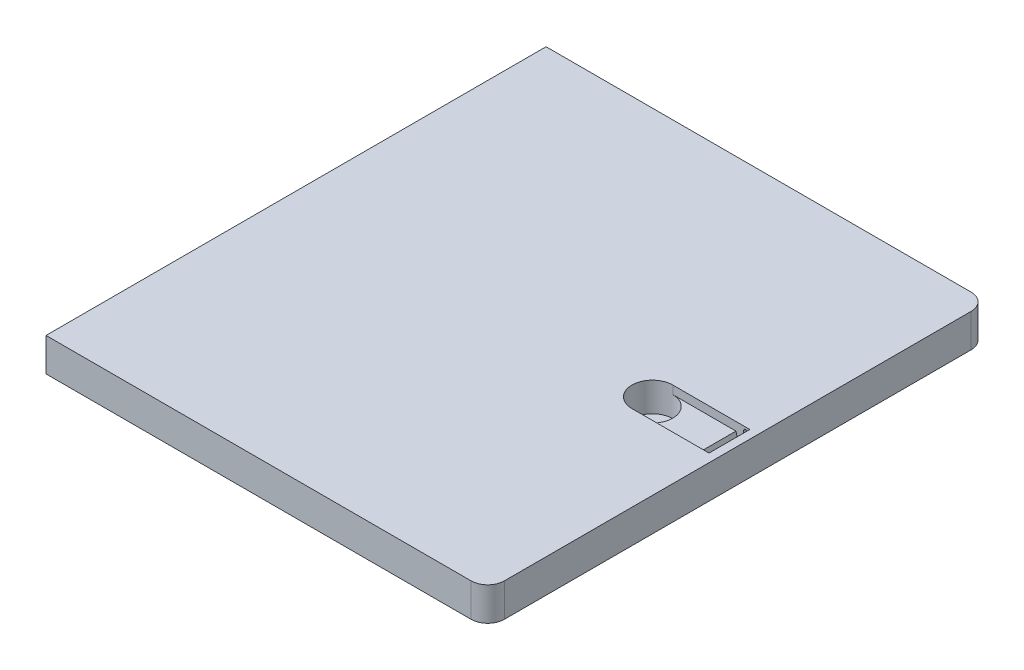
ISO-10303-21;
HEADER;
FILE_DESCRIPTION(('STEP AP214'),'2;1');
FILE_NAME('part.step','',(''),(''),'','','');
FILE_SCHEMA(('AUTOMOTIVE_DESIGN { 1 0 10303 214 1 1 1 1 }'));
ENDSEC;
DATA;
#1=APPLICATION_CONTEXT('core data for automotive mechanical design processes');
#2=APPLICATION_PROTOCOL_DEFINITION('international standard','automotive_design',2000,#1);
#3=PRODUCT_CONTEXT('',#1,'mechanical');
#4=PRODUCT('Part','Part','',(#3));
#5=PRODUCT_RELATED_PRODUCT_CATEGORY('part','',(#4));
#6=PRODUCT_DEFINITION_FORMATION('','',#4);
#7=PRODUCT_DEFINITION_CONTEXT('part definition',#1,'design');
#8=PRODUCT_DEFINITION('design','',#6,#7);
#9=PRODUCT_DEFINITION_SHAPE('','',#8);
#10=(LENGTH_UNIT() NAMED_UNIT(*) SI_UNIT(.MILLI.,.METRE.));
#11=(NAMED_UNIT(*) PLANE_ANGLE_UNIT() SI_UNIT($,.RADIAN.));
#12=(NAMED_UNIT(*) SI_UNIT($,.STERADIAN.) SOLID_ANGLE_UNIT());
#13=UNCERTAINTY_MEASURE_WITH_UNIT(LENGTH_MEASURE(1.E-05),#10,'distance_accuracy_value','');
#14=(GEOMETRIC_REPRESENTATION_CONTEXT(3) GLOBAL_UNCERTAINTY_ASSIGNED_CONTEXT((#13)) GLOBAL_UNIT_ASSIGNED_CONTEXT((#10,
#11,#12)) REPRESENTATION_CONTEXT('',''));
#15=CARTESIAN_POINT('',(0.,0.,0.));
#16=DIRECTION('',(0.,0.,1.));
#17=DIRECTION('',(1.,0.,0.));
#18=AXIS2_PLACEMENT_3D('',#15,#16,#17);
#19=CARTESIAN_POINT('',(0.,-8.,60.));
#20=DIRECTION('',(0.,0.,1.));
#21=DIRECTION('',(1.,0.,0.));
#22=AXIS2_PLACEMENT_3D('',#19,#20,#21);
#23=PLANE('',#22);
#24=DIRECTION('',(1.,0.,0.));
#25=VECTOR('',#24,1.);
#26=CARTESIAN_POINT('',(0.,-8.,60.));
#27=LINE('',#26,#25);
#28=CARTESIAN_POINT('',(-106.,-8.,60.));
#29=VERTEX_POINT('',#28);
#30=CARTESIAN_POINT('',(-4.,-8.,60.));
#31=VERTEX_POINT('',#30);
#32=EDGE_CURVE('E293',#29,#31,#27,.T.);
#33=ORIENTED_EDGE('',*,*,#32,.T.);
#34=DIRECTION('',(0.,1.,0.));
#35=VECTOR('',#34,1.);
#36=CARTESIAN_POINT('',(-4.,-8.,60.));
#37=LINE('',#36,#35);
#38=CARTESIAN_POINT('',(-4.,0.,60.));
#39=VERTEX_POINT('',#38);
#40=EDGE_CURVE('E308',#31,#39,#37,.T.);
#41=ORIENTED_EDGE('',*,*,#40,.T.);
#42=DIRECTION('',(1.,0.,0.));
#43=VECTOR('',#42,1.);
#44=CARTESIAN_POINT('',(0.,0.,60.));
#45=LINE('',#44,#43);
#46=CARTESIAN_POINT('',(-106.,0.,60.));
#47=VERTEX_POINT('',#46);
#48=EDGE_CURVE('E289',#47,#39,#45,.T.);
#49=ORIENTED_EDGE('',*,*,#48,.F.);
#50=DIRECTION('',(0.,1.,0.));
#51=VECTOR('',#50,1.);
#52=CARTESIAN_POINT('',(-106.,-8.,60.));
#53=LINE('',#52,#51);
#54=EDGE_CURVE('E306',#29,#47,#53,.T.);
#55=ORIENTED_EDGE('',*,*,#54,.F.);
#56=EDGE_LOOP('',(#33,#41,#49,#55));
#57=FACE_BOUND('',#56,.T.);
#58=ADVANCED_FACE('F32',(#57),#23,.T.);
#59=CARTESIAN_POINT('',(-106.,-8.,0.));
#60=DIRECTION('',(-1.,0.,0.));
#61=DIRECTION('',(0.,0.,1.));
#62=AXIS2_PLACEMENT_3D('',#59,#60,#61);
#63=PLANE('',#62);
#64=DIRECTION('',(0.,0.,1.));
#65=VECTOR('',#64,1.);
#66=CARTESIAN_POINT('',(-106.,0.,0.));
#67=LINE('',#66,#65);
#68=CARTESIAN_POINT('',(-106.,0.,-60.));
#69=VERTEX_POINT('',#68);
#70=EDGE_CURVE('E301',#69,#47,#67,.T.);
#71=ORIENTED_EDGE('',*,*,#70,.F.);
#72=DIRECTION('',(0.,1.,0.));
#73=VECTOR('',#72,1.);
#74=CARTESIAN_POINT('',(-106.,-8.,-60.));
#75=LINE('',#74,#73);
#76=CARTESIAN_POINT('',(-106.,-8.,-60.));
#77=VERTEX_POINT('',#76);
#78=EDGE_CURVE('E296',#77,#69,#75,.T.);
#79=ORIENTED_EDGE('',*,*,#78,.F.);
#80=DIRECTION('',(0.,0.,1.));
#81=VECTOR('',#80,1.);
#82=CARTESIAN_POINT('',(-106.,-8.,0.));
#83=LINE('',#82,#81);
#84=EDGE_CURVE('E291',#77,#29,#83,.T.);
#85=ORIENTED_EDGE('',*,*,#84,.T.);
#86=ORIENTED_EDGE('',*,*,#54,.T.);
#87=EDGE_LOOP('',(#71,#79,#85,#86));
#88=FACE_BOUND('',#87,.T.);
#89=ADVANCED_FACE('F358',(#88),#63,.T.);
#90=CARTESIAN_POINT('',(0.,-8.,-60.));
#91=DIRECTION('',(0.,0.,-1.));
#92=DIRECTION('',(-1.,0.,0.));
#93=AXIS2_PLACEMENT_3D('',#90,#91,#92);
#94=PLANE('',#93);
#95=DIRECTION('',(-1.,0.,0.));
#96=VECTOR('',#95,1.);
#97=CARTESIAN_POINT('',(0.,0.,-60.));
#98=LINE('',#97,#96);
#99=CARTESIAN_POINT('',(-4.,0.,-60.));
#100=VERTEX_POINT('',#99);
#101=EDGE_CURVE('E299',#100,#69,#98,.T.);
#102=ORIENTED_EDGE('',*,*,#101,.F.);
#103=DIRECTION('',(0.,1.,0.));
#104=VECTOR('',#103,1.);
#105=CARTESIAN_POINT('',(-4.,-8.,-60.));
#106=LINE('',#105,#104);
#107=CARTESIAN_POINT('',(-4.,-8.,-60.));
#108=VERTEX_POINT('',#107);
#109=EDGE_CURVE('E326',#100,#108,#106,.F.);
#110=ORIENTED_EDGE('',*,*,#109,.T.);
#111=DIRECTION('',(-1.,0.,0.));
#112=VECTOR('',#111,1.);
#113=CARTESIAN_POINT('',(0.,-8.,-60.));
#114=LINE('',#113,#112);
#115=EDGE_CURVE('E288',#108,#77,#114,.T.);
#116=ORIENTED_EDGE('',*,*,#115,.T.);
#117=ORIENTED_EDGE('',*,*,#78,.T.);
#118=EDGE_LOOP('',(#102,#110,#116,#117));
#119=FACE_BOUND('',#118,.T.);
#120=ADVANCED_FACE('F332',(#119),#94,.T.);
#121=CARTESIAN_POINT('',(0.,-8.,0.));
#122=DIRECTION('',(1.,0.,0.));
#123=DIRECTION('',(0.,0.,-1.));
#124=AXIS2_PLACEMENT_3D('',#121,#122,#123);
#125=PLANE('',#124);
#126=DIRECTION('',(0.,0.,-1.));
#127=VECTOR('',#126,1.);
#128=CARTESIAN_POINT('',(0.,0.,0.));
#129=LINE('',#128,#127);
#130=CARTESIAN_POINT('',(0.,0.,56.));
#131=VERTEX_POINT('',#130);
#132=CARTESIAN_POINT('',(0.,0.,-56.));
#133=VERTEX_POINT('',#132);
#134=EDGE_CURVE('E279',#131,#133,#129,.T.);
#135=ORIENTED_EDGE('',*,*,#134,.F.);
#136=DIRECTION('',(0.,1.,0.));
#137=VECTOR('',#136,1.);
#138=CARTESIAN_POINT('',(0.,-8.,56.));
#139=LINE('',#138,#137);
#140=CARTESIAN_POINT('',(0.,-8.,56.));
#141=VERTEX_POINT('',#140);
#142=EDGE_CURVE('E320',#131,#141,#139,.F.);
#143=ORIENTED_EDGE('',*,*,#142,.T.);
#144=DIRECTION('',(0.,0.,-1.));
#145=VECTOR('',#144,1.);
#146=CARTESIAN_POINT('',(0.,-8.,0.));
#147=LINE('',#146,#145);
#148=CARTESIAN_POINT('',(0.,-8.,-56.));
#149=VERTEX_POINT('',#148);
#150=EDGE_CURVE('E285',#141,#149,#147,.T.);
#151=ORIENTED_EDGE('',*,*,#150,.T.);
#152=DIRECTION('',(0.,1.,0.));
#153=VECTOR('',#152,1.);
#154=CARTESIAN_POINT('',(0.,-8.,-56.));
#155=LINE('',#154,#153);
#156=EDGE_CURVE('E317',#149,#133,#155,.T.);
#157=ORIENTED_EDGE('',*,*,#156,.T.);
#158=EDGE_LOOP('',(#135,#143,#151,#157));
#159=FACE_BOUND('',#158,.T.);
#160=ADVANCED_FACE('F345',(#159),#125,.T.);
#161=CARTESIAN_POINT('',(0.,-8.,0.));
#162=DIRECTION('',(0.,-1.,0.));
#163=DIRECTION('',(0.,0.,-1.));
#164=AXIS2_PLACEMENT_3D('',#161,#162,#163);
#165=PLANE('',#164);
#166=ORIENTED_EDGE('',*,*,#150,.F.);
#167=CARTESIAN_POINT('',(-4.,-8.,56.));
#168=DIRECTION('',(0.,-1.,0.));
#169=DIRECTION('',(0.,0.,-1.));
#170=AXIS2_PLACEMENT_3D('',#167,#168,#169);
#171=CIRCLE('',#170,4.);
#172=EDGE_CURVE('E324',#141,#31,#171,.T.);
#173=ORIENTED_EDGE('',*,*,#172,.T.);
#174=ORIENTED_EDGE('',*,*,#32,.F.);
#175=ORIENTED_EDGE('',*,*,#84,.F.);
#176=ORIENTED_EDGE('',*,*,#115,.F.);
#177=CARTESIAN_POINT('',(-4.,-8.,-56.));
#178=DIRECTION('',(0.,-1.,0.));
#179=DIRECTION('',(0.,0.,-1.));
#180=AXIS2_PLACEMENT_3D('',#177,#178,#179);
#181=CIRCLE('',#180,4.);
#182=EDGE_CURVE('E322',#108,#149,#181,.T.);
#183=ORIENTED_EDGE('',*,*,#182,.T.);
#184=EDGE_LOOP('',(#166,#173,#174,#175,#176,#183));
#185=FACE_BOUND('',#184,.T.);
#186=ADVANCED_FACE('F339',(#185),#165,.T.);
#187=CARTESIAN_POINT('',(0.,0.,0.));
#188=DIRECTION('',(0.,-1.,0.));
#189=DIRECTION('',(0.,0.,-1.));
#190=AXIS2_PLACEMENT_3D('',#187,#188,#189);
#191=PLANE('',#190);
#192=DIRECTION('',(0.,0.,-1.));
#193=VECTOR('',#192,1.);
#194=CARTESIAN_POINT('',(-2.,0.,0.));
#195=LINE('',#194,#193);
#196=CARTESIAN_POINT('',(-2.,0.,4.9));
#197=VERTEX_POINT('',#196);
#198=CARTESIAN_POINT('',(-2.,0.,-4.9));
#199=VERTEX_POINT('',#198);
#200=EDGE_CURVE('E258',#197,#199,#195,.T.);
#201=ORIENTED_EDGE('',*,*,#200,.F.);
#202=DIRECTION('',(1.,0.,0.));
#203=VECTOR('',#202,1.);
#204=CARTESIAN_POINT('',(-2.,0.,4.9));
#205=LINE('',#204,#203);
#206=CARTESIAN_POINT('',(-20.5,0.,4.9));
#207=VERTEX_POINT('',#206);
#208=EDGE_CURVE('E264',#207,#197,#205,.T.);
#209=ORIENTED_EDGE('',*,*,#208,.F.);
#210=CARTESIAN_POINT('',(-20.5,0.,0.));
#211=DIRECTION('',(0.,1.,0.));
#212=DIRECTION('',(0.,0.,1.));
#213=AXIS2_PLACEMENT_3D('',#210,#211,#212);
#214=CIRCLE('',#213,4.9);
#215=CARTESIAN_POINT('',(-20.5,0.,-4.9));
#216=VERTEX_POINT('',#215);
#217=EDGE_CURVE('E272',#216,#207,#214,.T.);
#218=ORIENTED_EDGE('',*,*,#217,.F.);
#219=DIRECTION('',(-1.,0.,0.));
#220=VECTOR('',#219,1.);
#221=CARTESIAN_POINT('',(-2.,0.,-4.9));
#222=LINE('',#221,#220);
#223=EDGE_CURVE('E269',#199,#216,#222,.T.);
#224=ORIENTED_EDGE('',*,*,#223,.F.);
#225=EDGE_LOOP('',(#201,#209,#218,#224));
#226=FACE_BOUND('',#225,.T.);
#227=ORIENTED_EDGE('',*,*,#48,.T.);
#228=CARTESIAN_POINT('',(-4.,0.,56.));
#229=DIRECTION('',(0.,-1.,0.));
#230=DIRECTION('',(0.,0.,-1.));
#231=AXIS2_PLACEMENT_3D('',#228,#229,#230);
#232=CIRCLE('',#231,4.);
#233=EDGE_CURVE('E315',#39,#131,#232,.F.);
#234=ORIENTED_EDGE('',*,*,#233,.T.);
#235=ORIENTED_EDGE('',*,*,#134,.T.);
#236=CARTESIAN_POINT('',(-4.,0.,-56.));
#237=DIRECTION('',(0.,-1.,0.));
#238=DIRECTION('',(0.,0.,-1.));
#239=AXIS2_PLACEMENT_3D('',#236,#237,#238);
#240=CIRCLE('',#239,4.);
#241=EDGE_CURVE('E313',#133,#100,#240,.F.);
#242=ORIENTED_EDGE('',*,*,#241,.T.);
#243=ORIENTED_EDGE('',*,*,#101,.T.);
#244=ORIENTED_EDGE('',*,*,#70,.T.);
#245=EDGE_LOOP('',(#227,#234,#235,#242,#243,#244));
#246=FACE_BOUND('',#245,.T.);
#247=ADVANCED_FACE('F348',(#226,#246),#191,.F.);
#248=CARTESIAN_POINT('',(-4.,-8.,56.));
#249=DIRECTION('',(0.,1.,0.));
#250=DIRECTION('',(0.,0.,1.));
#251=AXIS2_PLACEMENT_3D('',#248,#249,#250);
#252=CYLINDRICAL_SURFACE('',#251,4.);
#253=ORIENTED_EDGE('',*,*,#172,.F.);
#254=ORIENTED_EDGE('',*,*,#142,.F.);
#255=ORIENTED_EDGE('',*,*,#233,.F.);
#256=ORIENTED_EDGE('',*,*,#40,.F.);
#257=EDGE_LOOP('',(#253,#254,#255,#256));
#258=FACE_BOUND('',#257,.T.);
#259=ADVANCED_FACE('F353',(#258),#252,.T.);
#260=CARTESIAN_POINT('',(-4.,-8.,-56.));
#261=DIRECTION('',(0.,1.,0.));
#262=DIRECTION('',(0.,0.,1.));
#263=AXIS2_PLACEMENT_3D('',#260,#261,#262);
#264=CYLINDRICAL_SURFACE('',#263,4.);
#265=ORIENTED_EDGE('',*,*,#182,.F.);
#266=ORIENTED_EDGE('',*,*,#109,.F.);
#267=ORIENTED_EDGE('',*,*,#241,.F.);
#268=ORIENTED_EDGE('',*,*,#156,.F.);
#269=EDGE_LOOP('',(#265,#266,#267,#268));
#270=FACE_BOUND('',#269,.T.);
#271=ADVANCED_FACE('F342',(#270),#264,.T.);
#272=CARTESIAN_POINT('',(-2.,-2.,4.9));
#273=DIRECTION('',(0.,0.,1.));
#274=DIRECTION('',(1.,0.,0.));
#275=AXIS2_PLACEMENT_3D('',#272,#273,#274);
#276=PLANE('',#275);
#277=DIRECTION('',(0.,-1.,0.));
#278=VECTOR('',#277,1.);
#279=CARTESIAN_POINT('',(-2.5,-1.,4.9));
#280=LINE('',#279,#278);
#281=CARTESIAN_POINT('',(-2.5,-1.,4.9));
#282=VERTEX_POINT('',#281);
#283=CARTESIAN_POINT('',(-2.5,-6.,4.9));
#284=VERTEX_POINT('',#283);
#285=EDGE_CURVE('E201',#282,#284,#280,.T.);
#286=ORIENTED_EDGE('',*,*,#285,.F.);
#287=CARTESIAN_POINT('',(-3.,-1.,4.9));
#288=DIRECTION('',(0.,0.,-1.));
#289=DIRECTION('',(-1.,0.,0.));
#290=AXIS2_PLACEMENT_3D('',#287,#288,#289);
#291=CIRCLE('',#290,0.5);
#292=CARTESIAN_POINT('',(-3.5,-1.,4.9));
#293=VERTEX_POINT('',#292);
#294=EDGE_CURVE('E175',#293,#282,#291,.T.);
#295=ORIENTED_EDGE('',*,*,#294,.F.);
#296=DIRECTION('',(0.,1.,0.));
#297=VECTOR('',#296,1.);
#298=CARTESIAN_POINT('',(-3.5,-1.,4.9));
#299=LINE('',#298,#297);
#300=CARTESIAN_POINT('',(-3.5,-6.,4.9));
#301=VERTEX_POINT('',#300);
#302=EDGE_CURVE('E192',#301,#293,#299,.T.);
#303=ORIENTED_EDGE('',*,*,#302,.F.);
#304=CARTESIAN_POINT('',(-3.,-6.,4.9));
#305=DIRECTION('',(0.,0.,-1.));
#306=DIRECTION('',(-1.,0.,0.));
#307=AXIS2_PLACEMENT_3D('',#304,#305,#306);
#308=CIRCLE('',#307,0.5);
#309=EDGE_CURVE('E195',#284,#301,#308,.T.);
#310=ORIENTED_EDGE('',*,*,#309,.F.);
#311=EDGE_LOOP('',(#286,#295,#303,#310));
#312=FACE_BOUND('',#311,.T.);
#313=ORIENTED_EDGE('',*,*,#208,.T.);
#314=DIRECTION('',(0.,1.,0.));
#315=VECTOR('',#314,1.);
#316=CARTESIAN_POINT('',(-2.,-2.,4.9));
#317=LINE('',#316,#315);
#318=CARTESIAN_POINT('',(-2.,-7.,4.9));
#319=VERTEX_POINT('',#318);
#320=EDGE_CURVE('E276',#319,#197,#317,.T.);
#321=ORIENTED_EDGE('',*,*,#320,.F.);
#322=DIRECTION('',(1.,0.,0.));
#323=VECTOR('',#322,1.);
#324=CARTESIAN_POINT('',(-2.,-7.,4.9));
#325=LINE('',#324,#323);
#326=CARTESIAN_POINT('',(-4.,-7.,4.9));
#327=VERTEX_POINT('',#326);
#328=EDGE_CURVE('E251',#327,#319,#325,.T.);
#329=ORIENTED_EDGE('',*,*,#328,.F.);
#330=DIRECTION('',(-0.258819045102518,0.965925826289069,0.));
#331=VECTOR('',#330,1.);
#332=CARTESIAN_POINT('',(-5.11602540378444,-2.83493649053889,4.9));
#333=LINE('',#332,#331);
#334=CARTESIAN_POINT('',(-5.33974596215561,-2.,4.9));
#335=VERTEX_POINT('',#334);
#336=EDGE_CURVE('E40',#327,#335,#333,.T.);
#337=ORIENTED_EDGE('',*,*,#336,.T.);
#338=DIRECTION('',(1.,0.,0.));
#339=VECTOR('',#338,1.);
#340=CARTESIAN_POINT('',(-2.,-2.,4.9));
#341=LINE('',#340,#339);
#342=CARTESIAN_POINT('',(-20.5,-2.,4.9));
#343=VERTEX_POINT('',#342);
#344=EDGE_CURVE('E263',#343,#335,#341,.T.);
#345=ORIENTED_EDGE('',*,*,#344,.F.);
#346=DIRECTION('',(0.,1.,0.));
#347=VECTOR('',#346,1.);
#348=CARTESIAN_POINT('',(-20.5,-2.,4.9));
#349=LINE('',#348,#347);
#350=EDGE_CURVE('E280',#343,#207,#349,.T.);
#351=ORIENTED_EDGE('',*,*,#350,.T.);
#352=EDGE_LOOP('',(#313,#321,#329,#337,#345,#351));
#353=FACE_BOUND('',#352,.T.);
#354=ADVANCED_FACE('F373',(#312,#353),#276,.F.);
#355=CARTESIAN_POINT('',(-20.5,-2.,0.));
#356=DIRECTION('',(0.,1.,0.));
#357=DIRECTION('',(0.,0.,1.));
#358=AXIS2_PLACEMENT_3D('',#355,#356,#357);
#359=CYLINDRICAL_SURFACE('',#358,4.9);
#360=ORIENTED_EDGE('',*,*,#217,.T.);
#361=ORIENTED_EDGE('',*,*,#350,.F.);
#362=CARTESIAN_POINT('',(-20.5,-2.,0.));
#363=DIRECTION('',(0.,1.,0.));
#364=DIRECTION('',(0.,0.,1.));
#365=AXIS2_PLACEMENT_3D('',#362,#363,#364);
#366=CIRCLE('',#365,4.9);
#367=CARTESIAN_POINT('',(-20.5,-2.,-4.9));
#368=VERTEX_POINT('',#367);
#369=EDGE_CURVE('E254',#343,#368,#366,.T.);
#370=ORIENTED_EDGE('',*,*,#369,.T.);
#371=DIRECTION('',(0.,1.,0.));
#372=VECTOR('',#371,1.);
#373=CARTESIAN_POINT('',(-20.5,-2.,-4.9));
#374=LINE('',#373,#372);
#375=EDGE_CURVE('E282',#368,#216,#374,.T.);
#376=ORIENTED_EDGE('',*,*,#375,.T.);
#377=EDGE_LOOP('',(#360,#361,#370,#376));
#378=FACE_BOUND('',#377,.T.);
#379=CARTESIAN_POINT('',(-20.5,-7.,0.));
#380=DIRECTION('',(0.,1.,0.));
#381=DIRECTION('',(0.,0.,1.));
#382=AXIS2_PLACEMENT_3D('',#379,#380,#381);
#383=CIRCLE('',#382,4.9);
#384=CARTESIAN_POINT('',(-20.5,-7.,4.9));
#385=VERTEX_POINT('',#384);
#386=EDGE_CURVE('E255',#385,#385,#383,.T.);
#387=ORIENTED_EDGE('',*,*,#386,.F.);
#388=EDGE_LOOP('',(#387));
#389=FACE_BOUND('',#388,.T.);
#390=ADVANCED_FACE('F377',(#378,#389),#359,.F.);
#391=CARTESIAN_POINT('',(-2.,-2.,-4.9));
#392=DIRECTION('',(0.,0.,-1.));
#393=DIRECTION('',(-1.,0.,0.));
#394=AXIS2_PLACEMENT_3D('',#391,#392,#393);
#395=PLANE('',#394);
#396=DIRECTION('',(0.,-1.,0.));
#397=VECTOR('',#396,1.);
#398=CARTESIAN_POINT('',(-3.5,-1.,-4.9));
#399=LINE('',#398,#397);
#400=CARTESIAN_POINT('',(-3.5,-1.,-4.9));
#401=VERTEX_POINT('',#400);
#402=CARTESIAN_POINT('',(-3.5,-6.,-4.9));
#403=VERTEX_POINT('',#402);
#404=EDGE_CURVE('E226',#401,#403,#399,.T.);
#405=ORIENTED_EDGE('',*,*,#404,.F.);
#406=CARTESIAN_POINT('',(-3.,-1.,-4.9));
#407=DIRECTION('',(0.,0.,1.));
#408=DIRECTION('',(1.,0.,0.));
#409=AXIS2_PLACEMENT_3D('',#406,#407,#408);
#410=CIRCLE('',#409,0.5);
#411=CARTESIAN_POINT('',(-2.5,-1.,-4.9));
#412=VERTEX_POINT('',#411);
#413=EDGE_CURVE('E207',#412,#401,#410,.T.);
#414=ORIENTED_EDGE('',*,*,#413,.F.);
#415=DIRECTION('',(0.,1.,0.));
#416=VECTOR('',#415,1.);
#417=CARTESIAN_POINT('',(-2.5,-6.,-4.9));
#418=LINE('',#417,#416);
#419=CARTESIAN_POINT('',(-2.5,-6.,-4.9));
#420=VERTEX_POINT('',#419);
#421=EDGE_CURVE('E215',#420,#412,#418,.T.);
#422=ORIENTED_EDGE('',*,*,#421,.F.);
#423=CARTESIAN_POINT('',(-3.,-6.,-4.9));
#424=DIRECTION('',(0.,0.,1.));
#425=DIRECTION('',(1.,0.,0.));
#426=AXIS2_PLACEMENT_3D('',#423,#424,#425);
#427=CIRCLE('',#426,0.5);
#428=EDGE_CURVE('E229',#403,#420,#427,.T.);
#429=ORIENTED_EDGE('',*,*,#428,.F.);
#430=EDGE_LOOP('',(#405,#414,#422,#429));
#431=FACE_BOUND('',#430,.T.);
#432=ORIENTED_EDGE('',*,*,#223,.T.);
#433=ORIENTED_EDGE('',*,*,#375,.F.);
#434=DIRECTION('',(-1.,0.,0.));
#435=VECTOR('',#434,1.);
#436=CARTESIAN_POINT('',(-2.,-2.,-4.9));
#437=LINE('',#436,#435);
#438=CARTESIAN_POINT('',(-5.33974596215561,-2.,-4.9));
#439=VERTEX_POINT('',#438);
#440=EDGE_CURVE('E261',#439,#368,#437,.T.);
#441=ORIENTED_EDGE('',*,*,#440,.F.);
#442=DIRECTION('',(0.258819045102518,-0.965925826289069,0.));
#443=VECTOR('',#442,1.);
#444=CARTESIAN_POINT('',(-5.11602540378444,-2.83493649053889,-4.9));
#445=LINE('',#444,#443);
#446=CARTESIAN_POINT('',(-4.,-7.,-4.9));
#447=VERTEX_POINT('',#446);
#448=EDGE_CURVE('E11',#439,#447,#445,.T.);
#449=ORIENTED_EDGE('',*,*,#448,.T.);
#450=DIRECTION('',(-1.,0.,0.));
#451=VECTOR('',#450,1.);
#452=CARTESIAN_POINT('',(-2.,-7.,-4.9));
#453=LINE('',#452,#451);
#454=CARTESIAN_POINT('',(-2.,-7.,-4.9));
#455=VERTEX_POINT('',#454);
#456=EDGE_CURVE('E245',#455,#447,#453,.T.);
#457=ORIENTED_EDGE('',*,*,#456,.F.);
#458=DIRECTION('',(0.,1.,0.));
#459=VECTOR('',#458,1.);
#460=CARTESIAN_POINT('',(-2.,-2.,-4.9));
#461=LINE('',#460,#459);
#462=EDGE_CURVE('E266',#455,#199,#461,.T.);
#463=ORIENTED_EDGE('',*,*,#462,.T.);
#464=EDGE_LOOP('',(#432,#433,#441,#449,#457,#463));
#465=FACE_BOUND('',#464,.T.);
#466=ADVANCED_FACE('F383',(#431,#465),#395,.F.);
#467=CARTESIAN_POINT('',(-2.,-2.,0.));
#468=DIRECTION('',(1.,0.,0.));
#469=DIRECTION('',(0.,0.,-1.));
#470=AXIS2_PLACEMENT_3D('',#467,#468,#469);
#471=PLANE('',#470);
#472=ORIENTED_EDGE('',*,*,#200,.T.);
#473=ORIENTED_EDGE('',*,*,#462,.F.);
#474=DIRECTION('',(0.,0.,-1.));
#475=VECTOR('',#474,1.);
#476=CARTESIAN_POINT('',(-2.,-7.,-4.9));
#477=LINE('',#476,#475);
#478=EDGE_CURVE('E236',#319,#455,#477,.T.);
#479=ORIENTED_EDGE('',*,*,#478,.F.);
#480=ORIENTED_EDGE('',*,*,#320,.T.);
#481=EDGE_LOOP('',(#472,#473,#479,#480));
#482=FACE_BOUND('',#481,.T.);
#483=ADVANCED_FACE('F392',(#482),#471,.F.);
#484=CARTESIAN_POINT('',(-20.5,-2.,0.));
#485=DIRECTION('',(0.,1.,0.));
#486=DIRECTION('',(0.,0.,1.));
#487=AXIS2_PLACEMENT_3D('',#484,#485,#486);
#488=PLANE('',#487);
#489=ORIENTED_EDGE('',*,*,#344,.T.);
#490=DIRECTION('',(0.,0.,-1.));
#491=VECTOR('',#490,1.);
#492=CARTESIAN_POINT('',(-5.33974596215561,-2.,-4.9));
#493=LINE('',#492,#491);
#494=EDGE_CURVE('E53',#335,#439,#493,.T.);
#495=ORIENTED_EDGE('',*,*,#494,.T.);
#496=ORIENTED_EDGE('',*,*,#440,.T.);
#497=ORIENTED_EDGE('',*,*,#369,.F.);
#498=EDGE_LOOP('',(#489,#495,#496,#497));
#499=FACE_BOUND('',#498,.T.);
#500=ADVANCED_FACE('F387',(#499),#488,.T.);
#501=CARTESIAN_POINT('',(-20.5,-7.,0.));
#502=DIRECTION('',(0.,1.,0.));
#503=DIRECTION('',(0.,0.,1.));
#504=AXIS2_PLACEMENT_3D('',#501,#502,#503);
#505=PLANE('',#504);
#506=ORIENTED_EDGE('',*,*,#386,.T.);
#507=EDGE_LOOP('',(#506));
#508=FACE_BOUND('',#507,.T.);
#509=ADVANCED_FACE('F458',(#508),#505,.T.);
#510=CARTESIAN_POINT('',(0.,-7.,0.));
#511=DIRECTION('',(0.,-1.,0.));
#512=DIRECTION('',(0.,0.,-1.));
#513=AXIS2_PLACEMENT_3D('',#510,#511,#512);
#514=PLANE('',#513);
#515=ORIENTED_EDGE('',*,*,#478,.T.);
#516=ORIENTED_EDGE('',*,*,#456,.T.);
#517=DIRECTION('',(0.,0.,1.));
#518=VECTOR('',#517,1.);
#519=CARTESIAN_POINT('',(-4.,-7.,-4.9));
#520=LINE('',#519,#518);
#521=EDGE_CURVE('E248',#447,#327,#520,.T.);
#522=ORIENTED_EDGE('',*,*,#521,.T.);
#523=ORIENTED_EDGE('',*,*,#328,.T.);
#524=EDGE_LOOP('',(#515,#516,#522,#523));
#525=FACE_BOUND('',#524,.T.);
#526=ADVANCED_FACE('F415',(#525),#514,.F.);
#527=CARTESIAN_POINT('',(-3.,-1.,-6.9));
#528=DIRECTION('',(0.,0.,1.));
#529=DIRECTION('',(1.,0.,0.));
#530=AXIS2_PLACEMENT_3D('',#527,#528,#529);
#531=CYLINDRICAL_SURFACE('',#530,0.5);
#532=ORIENTED_EDGE('',*,*,#413,.T.);
#533=DIRECTION('',(0.,0.,1.));
#534=VECTOR('',#533,1.);
#535=CARTESIAN_POINT('',(-3.5,-1.,-6.9));
#536=LINE('',#535,#534);
#537=CARTESIAN_POINT('',(-3.5,-1.,-6.9));
#538=VERTEX_POINT('',#537);
#539=EDGE_CURVE('E224',#538,#401,#536,.T.);
#540=ORIENTED_EDGE('',*,*,#539,.F.);
#541=CARTESIAN_POINT('',(-3.,-1.,-6.9));
#542=DIRECTION('',(0.,0.,1.));
#543=DIRECTION('',(1.,0.,0.));
#544=AXIS2_PLACEMENT_3D('',#541,#542,#543);
#545=CIRCLE('',#544,0.5);
#546=CARTESIAN_POINT('',(-2.5,-1.,-6.9));
#547=VERTEX_POINT('',#546);
#548=EDGE_CURVE('E211',#547,#538,#545,.T.);
#549=ORIENTED_EDGE('',*,*,#548,.F.);
#550=DIRECTION('',(0.,0.,1.));
#551=VECTOR('',#550,1.);
#552=CARTESIAN_POINT('',(-2.5,-1.,-6.9));
#553=LINE('',#552,#551);
#554=EDGE_CURVE('E234',#547,#412,#553,.T.);
#555=ORIENTED_EDGE('',*,*,#554,.T.);
#556=EDGE_LOOP('',(#532,#540,#549,#555));
#557=FACE_BOUND('',#556,.T.);
#558=ADVANCED_FACE('F446',(#557),#531,.F.);
#559=CARTESIAN_POINT('',(-2.5,-6.,-6.9));
#560=DIRECTION('',(1.,0.,0.));
#561=DIRECTION('',(0.,0.,-1.));
#562=AXIS2_PLACEMENT_3D('',#559,#560,#561);
#563=PLANE('',#562);
#564=ORIENTED_EDGE('',*,*,#421,.T.);
#565=ORIENTED_EDGE('',*,*,#554,.F.);
#566=DIRECTION('',(0.,1.,0.));
#567=VECTOR('',#566,1.);
#568=CARTESIAN_POINT('',(-2.5,-6.,-6.9));
#569=LINE('',#568,#567);
#570=CARTESIAN_POINT('',(-2.5,-6.,-6.9));
#571=VERTEX_POINT('',#570);
#572=EDGE_CURVE('E221',#571,#547,#569,.T.);
#573=ORIENTED_EDGE('',*,*,#572,.F.);
#574=DIRECTION('',(0.,0.,1.));
#575=VECTOR('',#574,1.);
#576=CARTESIAN_POINT('',(-2.5,-6.,-6.9));
#577=LINE('',#576,#575);
#578=EDGE_CURVE('E237',#571,#420,#577,.T.);
#579=ORIENTED_EDGE('',*,*,#578,.T.);
#580=EDGE_LOOP('',(#564,#565,#573,#579));
#581=FACE_BOUND('',#580,.T.);
#582=ADVANCED_FACE('F442',(#581),#563,.F.);
#583=CARTESIAN_POINT('',(-3.,-6.,-6.9));
#584=DIRECTION('',(0.,0.,1.));
#585=DIRECTION('',(1.,0.,0.));
#586=AXIS2_PLACEMENT_3D('',#583,#584,#585);
#587=CYLINDRICAL_SURFACE('',#586,0.5);
#588=ORIENTED_EDGE('',*,*,#428,.T.);
#589=ORIENTED_EDGE('',*,*,#578,.F.);
#590=CARTESIAN_POINT('',(-3.,-6.,-6.9));
#591=DIRECTION('',(0.,0.,1.));
#592=DIRECTION('',(1.,0.,0.));
#593=AXIS2_PLACEMENT_3D('',#590,#591,#592);
#594=CIRCLE('',#593,0.5);
#595=CARTESIAN_POINT('',(-3.5,-6.,-6.9));
#596=VERTEX_POINT('',#595);
#597=EDGE_CURVE('E218',#596,#571,#594,.T.);
#598=ORIENTED_EDGE('',*,*,#597,.F.);
#599=DIRECTION('',(0.,0.,1.));
#600=VECTOR('',#599,1.);
#601=CARTESIAN_POINT('',(-3.5,-6.,-6.9));
#602=LINE('',#601,#600);
#603=EDGE_CURVE('E239',#596,#403,#602,.T.);
#604=ORIENTED_EDGE('',*,*,#603,.T.);
#605=EDGE_LOOP('',(#588,#589,#598,#604));
#606=FACE_BOUND('',#605,.T.);
#607=ADVANCED_FACE('F445',(#606),#587,.F.);
#608=CARTESIAN_POINT('',(-3.5,-1.,-6.9));
#609=DIRECTION('',(-1.,0.,0.));
#610=DIRECTION('',(0.,0.,1.));
#611=AXIS2_PLACEMENT_3D('',#608,#609,#610);
#612=PLANE('',#611);
#613=ORIENTED_EDGE('',*,*,#404,.T.);
#614=ORIENTED_EDGE('',*,*,#603,.F.);
#615=DIRECTION('',(0.,-1.,0.));
#616=VECTOR('',#615,1.);
#617=CARTESIAN_POINT('',(-3.5,-1.,-6.9));
#618=LINE('',#617,#616);
#619=EDGE_CURVE('E214',#538,#596,#618,.T.);
#620=ORIENTED_EDGE('',*,*,#619,.F.);
#621=ORIENTED_EDGE('',*,*,#539,.T.);
#622=EDGE_LOOP('',(#613,#614,#620,#621));
#623=FACE_BOUND('',#622,.T.);
#624=ADVANCED_FACE('F440',(#623),#612,.F.);
#625=CARTESIAN_POINT('',(-3.,-1.,-6.9));
#626=DIRECTION('',(0.,0.,1.));
#627=DIRECTION('',(1.,0.,0.));
#628=AXIS2_PLACEMENT_3D('',#625,#626,#627);
#629=PLANE('',#628);
#630=ORIENTED_EDGE('',*,*,#548,.T.);
#631=ORIENTED_EDGE('',*,*,#619,.T.);
#632=ORIENTED_EDGE('',*,*,#597,.T.);
#633=ORIENTED_EDGE('',*,*,#572,.T.);
#634=EDGE_LOOP('',(#630,#631,#632,#633));
#635=FACE_BOUND('',#634,.T.);
#636=ADVANCED_FACE('F437',(#635),#629,.T.);
#637=CARTESIAN_POINT('',(-3.,-1.,6.9));
#638=DIRECTION('',(0.,0.,-1.));
#639=DIRECTION('',(-1.,0.,0.));
#640=AXIS2_PLACEMENT_3D('',#637,#638,#639);
#641=CYLINDRICAL_SURFACE('',#640,0.5);
#642=ORIENTED_EDGE('',*,*,#294,.T.);
#643=DIRECTION('',(0.,0.,-1.));
#644=VECTOR('',#643,1.);
#645=CARTESIAN_POINT('',(-2.5,-1.,6.9));
#646=LINE('',#645,#644);
#647=CARTESIAN_POINT('',(-2.5,-1.,6.9));
#648=VERTEX_POINT('',#647);
#649=EDGE_CURVE('E168',#648,#282,#646,.T.);
#650=ORIENTED_EDGE('',*,*,#649,.F.);
#651=CARTESIAN_POINT('',(-3.,-1.,6.9));
#652=DIRECTION('',(0.,0.,-1.));
#653=DIRECTION('',(-1.,0.,0.));
#654=AXIS2_PLACEMENT_3D('',#651,#652,#653);
#655=CIRCLE('',#654,0.5);
#656=CARTESIAN_POINT('',(-3.5,-1.,6.9));
#657=VERTEX_POINT('',#656);
#658=EDGE_CURVE('E172',#657,#648,#655,.T.);
#659=ORIENTED_EDGE('',*,*,#658,.F.);
#660=DIRECTION('',(0.,0.,-1.));
#661=VECTOR('',#660,1.);
#662=CARTESIAN_POINT('',(-3.5,-1.,6.9));
#663=LINE('',#662,#661);
#664=EDGE_CURVE('E205',#657,#293,#663,.T.);
#665=ORIENTED_EDGE('',*,*,#664,.T.);
#666=EDGE_LOOP('',(#642,#650,#659,#665));
#667=FACE_BOUND('',#666,.T.);
#668=ADVANCED_FACE('F170',(#667),#641,.F.);
#669=CARTESIAN_POINT('',(-3.5,-1.,6.9));
#670=DIRECTION('',(-1.,0.,0.));
#671=DIRECTION('',(0.,0.,1.));
#672=AXIS2_PLACEMENT_3D('',#669,#670,#671);
#673=PLANE('',#672);
#674=ORIENTED_EDGE('',*,*,#302,.T.);
#675=ORIENTED_EDGE('',*,*,#664,.F.);
#676=DIRECTION('',(0.,1.,0.));
#677=VECTOR('',#676,1.);
#678=CARTESIAN_POINT('',(-3.5,-1.,6.9));
#679=LINE('',#678,#677);
#680=CARTESIAN_POINT('',(-3.5,-6.,6.9));
#681=VERTEX_POINT('',#680);
#682=EDGE_CURVE('E180',#681,#657,#679,.T.);
#683=ORIENTED_EDGE('',*,*,#682,.F.);
#684=DIRECTION('',(0.,0.,-1.));
#685=VECTOR('',#684,1.);
#686=CARTESIAN_POINT('',(-3.5,-6.,6.9));
#687=LINE('',#686,#685);
#688=EDGE_CURVE('E208',#681,#301,#687,.T.);
#689=ORIENTED_EDGE('',*,*,#688,.T.);
#690=EDGE_LOOP('',(#674,#675,#683,#689));
#691=FACE_BOUND('',#690,.T.);
#692=ADVANCED_FACE('F428',(#691),#673,.F.);
#693=CARTESIAN_POINT('',(-3.,-6.,6.9));
#694=DIRECTION('',(0.,0.,-1.));
#695=DIRECTION('',(-1.,0.,0.));
#696=AXIS2_PLACEMENT_3D('',#693,#694,#695);
#697=CYLINDRICAL_SURFACE('',#696,0.5);
#698=ORIENTED_EDGE('',*,*,#309,.T.);
#699=ORIENTED_EDGE('',*,*,#688,.F.);
#700=CARTESIAN_POINT('',(-3.,-6.,6.9));
#701=DIRECTION('',(0.,0.,-1.));
#702=DIRECTION('',(-1.,0.,0.));
#703=AXIS2_PLACEMENT_3D('',#700,#701,#702);
#704=CIRCLE('',#703,0.5);
#705=CARTESIAN_POINT('',(-2.5,-6.,6.9));
#706=VERTEX_POINT('',#705);
#707=EDGE_CURVE('E188',#706,#681,#704,.T.);
#708=ORIENTED_EDGE('',*,*,#707,.F.);
#709=DIRECTION('',(0.,0.,-1.));
#710=VECTOR('',#709,1.);
#711=CARTESIAN_POINT('',(-2.5,-6.,6.9));
#712=LINE('',#711,#710);
#713=EDGE_CURVE('E179',#706,#284,#712,.T.);
#714=ORIENTED_EDGE('',*,*,#713,.T.);
#715=EDGE_LOOP('',(#698,#699,#708,#714));
#716=FACE_BOUND('',#715,.T.);
#717=ADVANCED_FACE('F425',(#716),#697,.F.);
#718=CARTESIAN_POINT('',(-2.5,-1.,6.9));
#719=DIRECTION('',(1.,0.,0.));
#720=DIRECTION('',(0.,0.,-1.));
#721=AXIS2_PLACEMENT_3D('',#718,#719,#720);
#722=PLANE('',#721);
#723=ORIENTED_EDGE('',*,*,#285,.T.);
#724=ORIENTED_EDGE('',*,*,#713,.F.);
#725=DIRECTION('',(0.,-1.,0.));
#726=VECTOR('',#725,1.);
#727=CARTESIAN_POINT('',(-2.5,-1.,6.9));
#728=LINE('',#727,#726);
#729=EDGE_CURVE('E183',#648,#706,#728,.T.);
#730=ORIENTED_EDGE('',*,*,#729,.F.);
#731=ORIENTED_EDGE('',*,*,#649,.T.);
#732=EDGE_LOOP('',(#723,#724,#730,#731));
#733=FACE_BOUND('',#732,.T.);
#734=ADVANCED_FACE('F184',(#733),#722,.F.);
#735=CARTESIAN_POINT('',(-3.,-1.,6.9));
#736=DIRECTION('',(0.,0.,-1.));
#737=DIRECTION('',(-1.,0.,0.));
#738=AXIS2_PLACEMENT_3D('',#735,#736,#737);
#739=PLANE('',#738);
#740=ORIENTED_EDGE('',*,*,#658,.T.);
#741=ORIENTED_EDGE('',*,*,#729,.T.);
#742=ORIENTED_EDGE('',*,*,#707,.T.);
#743=ORIENTED_EDGE('',*,*,#682,.T.);
#744=EDGE_LOOP('',(#740,#741,#742,#743));
#745=FACE_BOUND('',#744,.T.);
#746=ADVANCED_FACE('F190',(#745),#739,.T.);
#747=CARTESIAN_POINT('',(-4.,-7.00000000000003,-4.9));
#748=DIRECTION('',(0.965925826289069,0.258819045102518,0.));
#749=DIRECTION('',(0.,0.,-1.));
#750=AXIS2_PLACEMENT_3D('',#747,#748,#749);
#751=PLANE('',#750);
#752=ORIENTED_EDGE('',*,*,#448,.F.);
#753=ORIENTED_EDGE('',*,*,#494,.F.);
#754=ORIENTED_EDGE('',*,*,#336,.F.);
#755=ORIENTED_EDGE('',*,*,#521,.F.);
#756=EDGE_LOOP('',(#752,#753,#754,#755));
#757=FACE_BOUND('',#756,.T.);
#758=ADVANCED_FACE('F34',(#757),#751,.T.);
#759=CLOSED_SHELL('',(#58,#89,#120,#160,#186,#247,#259,#271,#354,#390,#466,#483,#500,#509,#526,
#558,#582,#607,#624,#636,#668,#692,#717,#734,#746,#758));
#760=MANIFOLD_SOLID_BREP('B2',#759);
#761=ADVANCED_BREP_SHAPE_REPRESENTATION('',(#18,#760),#14);
#762=SHAPE_DEFINITION_REPRESENTATION(#9,#761);
ENDSEC;
END-ISO-10303-21;
